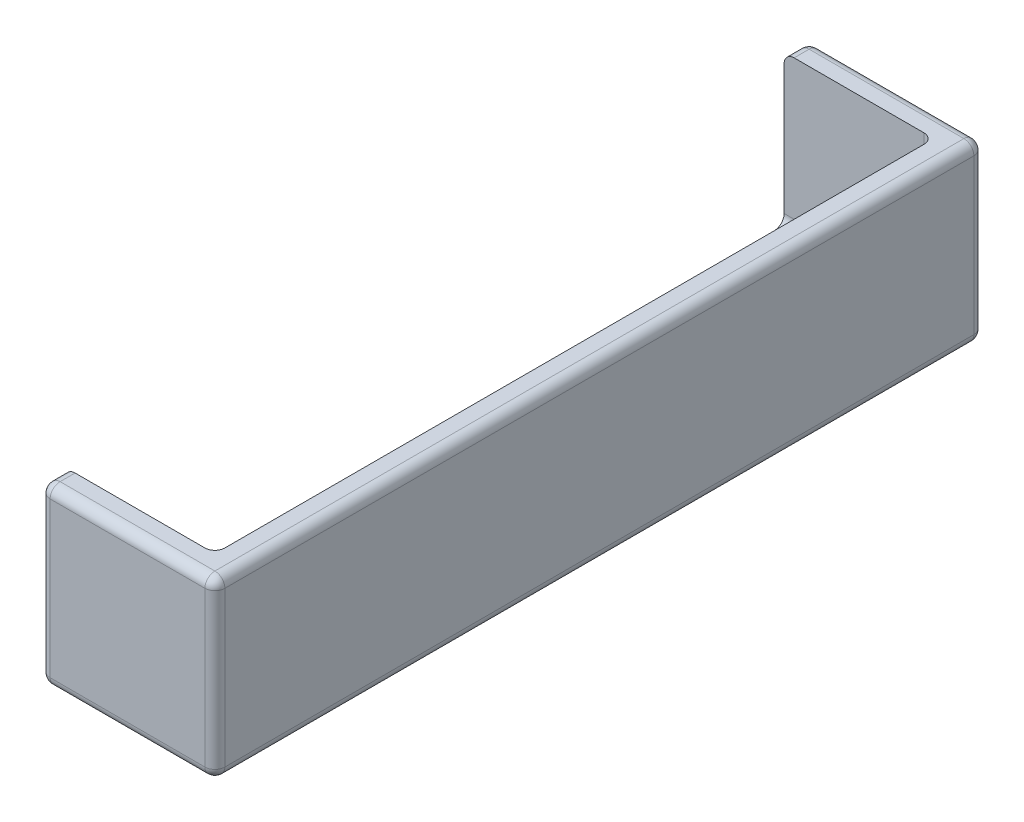
ISO-10303-21;
HEADER;
FILE_DESCRIPTION(('STEP AP214'),'2;1');
FILE_NAME('part.step','',(''),(''),'','','');
FILE_SCHEMA(('AUTOMOTIVE_DESIGN { 1 0 10303 214 1 1 1 1 }'));
ENDSEC;
DATA;
#1=APPLICATION_CONTEXT('core data for automotive mechanical design processes');
#2=APPLICATION_PROTOCOL_DEFINITION('international standard','automotive_design',2000,#1);
#3=PRODUCT_CONTEXT('',#1,'mechanical');
#4=PRODUCT('Part','Part','',(#3));
#5=PRODUCT_RELATED_PRODUCT_CATEGORY('part','',(#4));
#6=PRODUCT_DEFINITION_FORMATION('','',#4);
#7=PRODUCT_DEFINITION_CONTEXT('part definition',#1,'design');
#8=PRODUCT_DEFINITION('design','',#6,#7);
#9=PRODUCT_DEFINITION_SHAPE('','',#8);
#10=(LENGTH_UNIT() NAMED_UNIT(*) SI_UNIT(.MILLI.,.METRE.));
#11=(NAMED_UNIT(*) PLANE_ANGLE_UNIT() SI_UNIT($,.RADIAN.));
#12=(NAMED_UNIT(*) SI_UNIT($,.STERADIAN.) SOLID_ANGLE_UNIT());
#13=UNCERTAINTY_MEASURE_WITH_UNIT(LENGTH_MEASURE(1.E-05),#10,'distance_accuracy_value','');
#14=(GEOMETRIC_REPRESENTATION_CONTEXT(3) GLOBAL_UNCERTAINTY_ASSIGNED_CONTEXT((#13)) GLOBAL_UNIT_ASSIGNED_CONTEXT((#10,
#11,#12)) REPRESENTATION_CONTEXT('',''));
#15=CARTESIAN_POINT('',(0.,0.,0.));
#16=DIRECTION('',(0.,0.,1.));
#17=DIRECTION('',(1.,0.,0.));
#18=AXIS2_PLACEMENT_3D('',#15,#16,#17);
#19=CARTESIAN_POINT('',(17.5,0.,77.));
#20=DIRECTION('',(0.,-1.,0.));
#21=DIRECTION('',(0.,0.,-1.));
#22=AXIS2_PLACEMENT_3D('',#19,#20,#21);
#23=PLANE('',#22);
#24=DIRECTION('',(-1.,0.,0.));
#25=VECTOR('',#24,1.);
#26=CARTESIAN_POINT('',(0.,0.,76.));
#27=LINE('',#26,#25);
#28=CARTESIAN_POINT('',(16.5,0.,76.));
#29=VERTEX_POINT('',#28);
#30=CARTESIAN_POINT('',(1.,0.,76.));
#31=VERTEX_POINT('',#30);
#32=EDGE_CURVE('E383',#29,#31,#27,.T.);
#33=ORIENTED_EDGE('',*,*,#32,.T.);
#34=DIRECTION('',(0.,0.,-1.));
#35=VECTOR('',#34,1.);
#36=CARTESIAN_POINT('',(1.,0.,77.));
#37=LINE('',#36,#35);
#38=CARTESIAN_POINT('',(1.,0.,1.));
#39=VERTEX_POINT('',#38);
#40=EDGE_CURVE('E385',#31,#39,#37,.T.);
#41=ORIENTED_EDGE('',*,*,#40,.T.);
#42=DIRECTION('',(-1.,0.,0.));
#43=VECTOR('',#42,1.);
#44=CARTESIAN_POINT('',(17.5,0.,1.));
#45=LINE('',#44,#43);
#46=CARTESIAN_POINT('',(16.5,0.,1.));
#47=VERTEX_POINT('',#46);
#48=EDGE_CURVE('E379',#39,#47,#45,.F.);
#49=ORIENTED_EDGE('',*,*,#48,.T.);
#50=DIRECTION('',(0.,0.,-1.));
#51=VECTOR('',#50,1.);
#52=CARTESIAN_POINT('',(16.5,0.,77.));
#53=LINE('',#52,#51);
#54=EDGE_CURVE('E381',#47,#29,#53,.F.);
#55=ORIENTED_EDGE('',*,*,#54,.T.);
#56=EDGE_LOOP('',(#33,#41,#49,#55));
#57=FACE_BOUND('',#56,.T.);
#58=ADVANCED_FACE('F35',(#57),#23,.T.);
#59=CARTESIAN_POINT('',(17.5,17.5,77.));
#60=DIRECTION('',(1.,0.,0.));
#61=DIRECTION('',(0.,1.,0.));
#62=AXIS2_PLACEMENT_3D('',#59,#60,#61);
#63=PLANE('',#62);
#64=DIRECTION('',(0.,-1.,0.));
#65=VECTOR('',#64,1.);
#66=CARTESIAN_POINT('',(17.5,17.5,1.));
#67=LINE('',#66,#65);
#68=CARTESIAN_POINT('',(17.5,1.,1.));
#69=VERTEX_POINT('',#68);
#70=CARTESIAN_POINT('',(17.5,16.5,1.));
#71=VERTEX_POINT('',#70);
#72=EDGE_CURVE('E334',#69,#71,#67,.F.);
#73=ORIENTED_EDGE('',*,*,#72,.T.);
#74=DIRECTION('',(0.,0.,-1.));
#75=VECTOR('',#74,1.);
#76=CARTESIAN_POINT('',(17.5,16.5,77.));
#77=LINE('',#76,#75);
#78=CARTESIAN_POINT('',(17.5,16.5,76.));
#79=VERTEX_POINT('',#78);
#80=EDGE_CURVE('E340',#71,#79,#77,.F.);
#81=ORIENTED_EDGE('',*,*,#80,.T.);
#82=DIRECTION('',(0.,-1.,0.));
#83=VECTOR('',#82,1.);
#84=CARTESIAN_POINT('',(17.5,0.,76.));
#85=LINE('',#84,#83);
#86=CARTESIAN_POINT('',(17.5,1.,76.));
#87=VERTEX_POINT('',#86);
#88=EDGE_CURVE('E338',#79,#87,#85,.T.);
#89=ORIENTED_EDGE('',*,*,#88,.T.);
#90=DIRECTION('',(0.,0.,-1.));
#91=VECTOR('',#90,1.);
#92=CARTESIAN_POINT('',(17.5,1.,77.));
#93=LINE('',#92,#91);
#94=EDGE_CURVE('E336',#87,#69,#93,.T.);
#95=ORIENTED_EDGE('',*,*,#94,.T.);
#96=EDGE_LOOP('',(#73,#81,#89,#95));
#97=FACE_BOUND('',#96,.T.);
#98=ADVANCED_FACE('F455',(#97),#63,.T.);
#99=CARTESIAN_POINT('',(0.,17.5,77.));
#100=DIRECTION('',(0.,1.,0.));
#101=DIRECTION('',(0.,0.,1.));
#102=AXIS2_PLACEMENT_3D('',#99,#100,#101);
#103=PLANE('',#102);
#104=DIRECTION('',(1.,0.,0.));
#105=VECTOR('',#104,1.);
#106=CARTESIAN_POINT('',(0.,17.5,74.5));
#107=LINE('',#106,#105);
#108=CARTESIAN_POINT('',(1.,17.5,74.5));
#109=VERTEX_POINT('',#108);
#110=CARTESIAN_POINT('',(14.,17.5,74.5));
#111=VERTEX_POINT('',#110);
#112=EDGE_CURVE('E199',#109,#111,#107,.T.);
#113=ORIENTED_EDGE('',*,*,#112,.F.);
#114=DIRECTION('',(0.,0.,-1.));
#115=VECTOR('',#114,1.);
#116=CARTESIAN_POINT('',(1.,17.5,77.));
#117=LINE('',#116,#115);
#118=CARTESIAN_POINT('',(1.,17.5,76.));
#119=VERTEX_POINT('',#118);
#120=EDGE_CURVE('E332',#109,#119,#117,.F.);
#121=ORIENTED_EDGE('',*,*,#120,.T.);
#122=DIRECTION('',(1.,0.,0.));
#123=VECTOR('',#122,1.);
#124=CARTESIAN_POINT('',(17.5,17.5,76.));
#125=LINE('',#124,#123);
#126=CARTESIAN_POINT('',(16.5,17.5,76.));
#127=VERTEX_POINT('',#126);
#128=EDGE_CURVE('E330',#119,#127,#125,.T.);
#129=ORIENTED_EDGE('',*,*,#128,.T.);
#130=DIRECTION('',(0.,0.,-1.));
#131=VECTOR('',#130,1.);
#132=CARTESIAN_POINT('',(16.5,17.5,77.));
#133=LINE('',#132,#131);
#134=CARTESIAN_POINT('',(16.5,17.5,1.));
#135=VERTEX_POINT('',#134);
#136=EDGE_CURVE('E327',#127,#135,#133,.T.);
#137=ORIENTED_EDGE('',*,*,#136,.T.);
#138=DIRECTION('',(1.,0.,0.));
#139=VECTOR('',#138,1.);
#140=CARTESIAN_POINT('',(0.,17.5,1.));
#141=LINE('',#140,#139);
#142=CARTESIAN_POINT('',(1.,17.5,1.));
#143=VERTEX_POINT('',#142);
#144=EDGE_CURVE('E321',#135,#143,#141,.F.);
#145=ORIENTED_EDGE('',*,*,#144,.T.);
#146=DIRECTION('',(0.,0.,-1.));
#147=VECTOR('',#146,1.);
#148=CARTESIAN_POINT('',(1.,17.5,77.));
#149=LINE('',#148,#147);
#150=CARTESIAN_POINT('',(1.,17.5,2.5));
#151=VERTEX_POINT('',#150);
#152=EDGE_CURVE('E197',#143,#151,#149,.F.);
#153=ORIENTED_EDGE('',*,*,#152,.T.);
#154=DIRECTION('',(-1.,0.,0.));
#155=VECTOR('',#154,1.);
#156=CARTESIAN_POINT('',(0.,17.5,2.5));
#157=LINE('',#156,#155);
#158=CARTESIAN_POINT('',(14.,17.5,2.5));
#159=VERTEX_POINT('',#158);
#160=EDGE_CURVE('E182',#159,#151,#157,.T.);
#161=ORIENTED_EDGE('',*,*,#160,.F.);
#162=CARTESIAN_POINT('',(14.,17.5,3.5));
#163=DIRECTION('',(0.,1.,0.));
#164=DIRECTION('',(0.,0.,1.));
#165=AXIS2_PLACEMENT_3D('',#162,#163,#164);
#166=CIRCLE('',#165,1.);
#167=CARTESIAN_POINT('',(15.,17.5,3.5));
#168=VERTEX_POINT('',#167);
#169=EDGE_CURVE('E11',#159,#168,#166,.F.);
#170=ORIENTED_EDGE('',*,*,#169,.T.);
#171=DIRECTION('',(0.,0.,1.));
#172=VECTOR('',#171,1.);
#173=CARTESIAN_POINT('',(15.,17.5,77.));
#174=LINE('',#173,#172);
#175=CARTESIAN_POINT('',(15.,17.5,73.5));
#176=VERTEX_POINT('',#175);
#177=EDGE_CURVE('E319',#168,#176,#174,.T.);
#178=ORIENTED_EDGE('',*,*,#177,.T.);
#179=CARTESIAN_POINT('',(14.,17.5,73.5));
#180=DIRECTION('',(0.,1.,0.));
#181=DIRECTION('',(0.,0.,1.));
#182=AXIS2_PLACEMENT_3D('',#179,#180,#181);
#183=CIRCLE('',#182,1.);
#184=EDGE_CURVE('E214',#176,#111,#183,.F.);
#185=ORIENTED_EDGE('',*,*,#184,.T.);
#186=EDGE_LOOP('',(#113,#121,#129,#137,#145,#153,#161,#170,#178,#185));
#187=FACE_BOUND('',#186,.T.);
#188=ADVANCED_FACE('F194',(#187),#103,.T.);
#189=CARTESIAN_POINT('',(0.,0.,77.));
#190=DIRECTION('',(-1.,0.,0.));
#191=DIRECTION('',(0.,0.,1.));
#192=AXIS2_PLACEMENT_3D('',#189,#190,#191);
#193=PLANE('',#192);
#194=DIRECTION('',(0.,-1.,0.));
#195=VECTOR('',#194,1.);
#196=CARTESIAN_POINT('',(0.,0.,2.5));
#197=LINE('',#196,#195);
#198=CARTESIAN_POINT('',(0.,16.5,2.5));
#199=VERTEX_POINT('',#198);
#200=CARTESIAN_POINT('',(0.,3.5,2.5));
#201=VERTEX_POINT('',#200);
#202=EDGE_CURVE('E198',#199,#201,#197,.T.);
#203=ORIENTED_EDGE('',*,*,#202,.F.);
#204=DIRECTION('',(0.,0.,-1.));
#205=VECTOR('',#204,1.);
#206=CARTESIAN_POINT('',(0.,16.5,77.));
#207=LINE('',#206,#205);
#208=CARTESIAN_POINT('',(0.,16.5,1.));
#209=VERTEX_POINT('',#208);
#210=EDGE_CURVE('E190',#199,#209,#207,.T.);
#211=ORIENTED_EDGE('',*,*,#210,.T.);
#212=DIRECTION('',(0.,1.,0.));
#213=VECTOR('',#212,1.);
#214=CARTESIAN_POINT('',(0.,0.,1.));
#215=LINE('',#214,#213);
#216=CARTESIAN_POINT('',(0.,1.,1.));
#217=VERTEX_POINT('',#216);
#218=EDGE_CURVE('E345',#209,#217,#215,.F.);
#219=ORIENTED_EDGE('',*,*,#218,.T.);
#220=DIRECTION('',(0.,0.,-1.));
#221=VECTOR('',#220,1.);
#222=CARTESIAN_POINT('',(0.,1.,77.));
#223=LINE('',#222,#221);
#224=CARTESIAN_POINT('',(0.,1.,76.));
#225=VERTEX_POINT('',#224);
#226=EDGE_CURVE('E343',#217,#225,#223,.F.);
#227=ORIENTED_EDGE('',*,*,#226,.T.);
#228=DIRECTION('',(0.,1.,0.));
#229=VECTOR('',#228,1.);
#230=CARTESIAN_POINT('',(0.,17.5,76.));
#231=LINE('',#230,#229);
#232=CARTESIAN_POINT('',(0.,16.5,76.));
#233=VERTEX_POINT('',#232);
#234=EDGE_CURVE('E347',#225,#233,#231,.T.);
#235=ORIENTED_EDGE('',*,*,#234,.T.);
#236=DIRECTION('',(0.,0.,-1.));
#237=VECTOR('',#236,1.);
#238=CARTESIAN_POINT('',(0.,16.5,77.));
#239=LINE('',#238,#237);
#240=CARTESIAN_POINT('',(0.,16.5,74.5));
#241=VERTEX_POINT('',#240);
#242=EDGE_CURVE('E349',#233,#241,#239,.T.);
#243=ORIENTED_EDGE('',*,*,#242,.T.);
#244=DIRECTION('',(0.,1.,0.));
#245=VECTOR('',#244,1.);
#246=CARTESIAN_POINT('',(0.,22.5,74.5));
#247=LINE('',#246,#245);
#248=CARTESIAN_POINT('',(0.,3.5,74.5));
#249=VERTEX_POINT('',#248);
#250=EDGE_CURVE('E401',#249,#241,#247,.T.);
#251=ORIENTED_EDGE('',*,*,#250,.F.);
#252=CARTESIAN_POINT('',(0.,3.5,73.5));
#253=DIRECTION('',(-1.,0.,0.));
#254=DIRECTION('',(0.,0.,1.));
#255=AXIS2_PLACEMENT_3D('',#252,#253,#254);
#256=CIRCLE('',#255,1.);
#257=CARTESIAN_POINT('',(0.,2.5,73.5));
#258=VERTEX_POINT('',#257);
#259=EDGE_CURVE('E207',#249,#258,#256,.F.);
#260=ORIENTED_EDGE('',*,*,#259,.T.);
#261=DIRECTION('',(0.,0.,1.));
#262=VECTOR('',#261,1.);
#263=CARTESIAN_POINT('',(0.,2.5,2.5));
#264=LINE('',#263,#262);
#265=CARTESIAN_POINT('',(0.,2.5,3.5));
#266=VERTEX_POINT('',#265);
#267=EDGE_CURVE('E286',#266,#258,#264,.T.);
#268=ORIENTED_EDGE('',*,*,#267,.F.);
#269=CARTESIAN_POINT('',(0.,3.5,3.5));
#270=DIRECTION('',(-1.,0.,0.));
#271=DIRECTION('',(0.,0.,1.));
#272=AXIS2_PLACEMENT_3D('',#269,#270,#271);
#273=CIRCLE('',#272,1.);
#274=EDGE_CURVE('E44',#266,#201,#273,.F.);
#275=ORIENTED_EDGE('',*,*,#274,.T.);
#276=EDGE_LOOP('',(#203,#211,#219,#227,#235,#243,#251,#260,#268,#275));
#277=FACE_BOUND('',#276,.T.);
#278=ADVANCED_FACE('F405',(#277),#193,.T.);
#279=CARTESIAN_POINT('',(0.,0.,77.));
#280=DIRECTION('',(0.,0.,-1.));
#281=DIRECTION('',(-1.,0.,0.));
#282=AXIS2_PLACEMENT_3D('',#279,#280,#281);
#283=PLANE('',#282);
#284=DIRECTION('',(1.,0.,0.));
#285=VECTOR('',#284,1.);
#286=CARTESIAN_POINT('',(0.,16.5,77.));
#287=LINE('',#286,#285);
#288=CARTESIAN_POINT('',(16.5,16.5,77.));
#289=VERTEX_POINT('',#288);
#290=CARTESIAN_POINT('',(1.,16.5,77.));
#291=VERTEX_POINT('',#290);
#292=EDGE_CURVE('E365',#289,#291,#287,.F.);
#293=ORIENTED_EDGE('',*,*,#292,.T.);
#294=DIRECTION('',(0.,1.,0.));
#295=VECTOR('',#294,1.);
#296=CARTESIAN_POINT('',(1.,0.,77.));
#297=LINE('',#296,#295);
#298=CARTESIAN_POINT('',(1.,1.,77.));
#299=VERTEX_POINT('',#298);
#300=EDGE_CURVE('E367',#291,#299,#297,.F.);
#301=ORIENTED_EDGE('',*,*,#300,.T.);
#302=DIRECTION('',(-1.,0.,0.));
#303=VECTOR('',#302,1.);
#304=CARTESIAN_POINT('',(17.5,1.,77.));
#305=LINE('',#304,#303);
#306=CARTESIAN_POINT('',(16.5,1.,77.));
#307=VERTEX_POINT('',#306);
#308=EDGE_CURVE('E361',#299,#307,#305,.F.);
#309=ORIENTED_EDGE('',*,*,#308,.T.);
#310=DIRECTION('',(0.,-1.,0.));
#311=VECTOR('',#310,1.);
#312=CARTESIAN_POINT('',(16.5,17.5,77.));
#313=LINE('',#312,#311);
#314=EDGE_CURVE('E363',#307,#289,#313,.F.);
#315=ORIENTED_EDGE('',*,*,#314,.T.);
#316=EDGE_LOOP('',(#293,#301,#309,#315));
#317=FACE_BOUND('',#316,.T.);
#318=ADVANCED_FACE('F721',(#317),#283,.F.);
#319=CARTESIAN_POINT('',(0.,0.,0.));
#320=DIRECTION('',(0.,0.,-1.));
#321=DIRECTION('',(-1.,0.,0.));
#322=AXIS2_PLACEMENT_3D('',#319,#320,#321);
#323=PLANE('',#322);
#324=DIRECTION('',(0.,1.,0.));
#325=VECTOR('',#324,1.);
#326=CARTESIAN_POINT('',(1.,0.,0.));
#327=LINE('',#326,#325);
#328=CARTESIAN_POINT('',(1.,1.,0.));
#329=VERTEX_POINT('',#328);
#330=CARTESIAN_POINT('',(1.,16.5,0.));
#331=VERTEX_POINT('',#330);
#332=EDGE_CURVE('E374',#329,#331,#327,.T.);
#333=ORIENTED_EDGE('',*,*,#332,.T.);
#334=DIRECTION('',(1.,0.,0.));
#335=VECTOR('',#334,1.);
#336=CARTESIAN_POINT('',(0.,16.5,0.));
#337=LINE('',#336,#335);
#338=CARTESIAN_POINT('',(16.5,16.5,0.));
#339=VERTEX_POINT('',#338);
#340=EDGE_CURVE('E376',#331,#339,#337,.T.);
#341=ORIENTED_EDGE('',*,*,#340,.T.);
#342=DIRECTION('',(0.,-1.,0.));
#343=VECTOR('',#342,1.);
#344=CARTESIAN_POINT('',(16.5,0.,0.));
#345=LINE('',#344,#343);
#346=CARTESIAN_POINT('',(16.5,1.,0.));
#347=VERTEX_POINT('',#346);
#348=EDGE_CURVE('E372',#339,#347,#345,.T.);
#349=ORIENTED_EDGE('',*,*,#348,.T.);
#350=DIRECTION('',(-1.,0.,0.));
#351=VECTOR('',#350,1.);
#352=CARTESIAN_POINT('',(0.,1.,0.));
#353=LINE('',#352,#351);
#354=EDGE_CURVE('E370',#347,#329,#353,.T.);
#355=ORIENTED_EDGE('',*,*,#354,.T.);
#356=EDGE_LOOP('',(#333,#341,#349,#355));
#357=FACE_BOUND('',#356,.T.);
#358=ADVANCED_FACE('F713',(#357),#323,.T.);
#359=CARTESIAN_POINT('',(15.,22.5,2.5));
#360=DIRECTION('',(0.,0.,-1.));
#361=DIRECTION('',(-1.,0.,0.));
#362=AXIS2_PLACEMENT_3D('',#359,#360,#361);
#363=PLANE('',#362);
#364=ORIENTED_EDGE('',*,*,#160,.T.);
#365=CARTESIAN_POINT('',(1.,16.5,2.5));
#366=DIRECTION('',(0.,0.,-1.));
#367=DIRECTION('',(-1.,0.,0.));
#368=AXIS2_PLACEMENT_3D('',#365,#366,#367);
#369=CIRCLE('',#368,1.);
#370=EDGE_CURVE('E353',#151,#199,#369,.F.);
#371=ORIENTED_EDGE('',*,*,#370,.T.);
#372=ORIENTED_EDGE('',*,*,#202,.T.);
#373=DIRECTION('',(-1.,0.,0.));
#374=VECTOR('',#373,1.);
#375=CARTESIAN_POINT('',(15.,3.5,2.5));
#376=LINE('',#375,#374);
#377=CARTESIAN_POINT('',(14.,3.5,2.5));
#378=VERTEX_POINT('',#377);
#379=EDGE_CURVE('E186',#201,#378,#376,.F.);
#380=ORIENTED_EDGE('',*,*,#379,.T.);
#381=DIRECTION('',(0.,-1.,0.));
#382=VECTOR('',#381,1.);
#383=CARTESIAN_POINT('',(14.,22.5,2.5));
#384=LINE('',#383,#382);
#385=EDGE_CURVE('E179',#378,#159,#384,.F.);
#386=ORIENTED_EDGE('',*,*,#385,.T.);
#387=EDGE_LOOP('',(#364,#371,#372,#380,#386));
#388=FACE_BOUND('',#387,.T.);
#389=ADVANCED_FACE('F181',(#388),#363,.F.);
#390=CARTESIAN_POINT('',(15.,22.5,74.5));
#391=DIRECTION('',(0.,0.,1.));
#392=DIRECTION('',(1.,0.,0.));
#393=AXIS2_PLACEMENT_3D('',#390,#391,#392);
#394=PLANE('',#393);
#395=ORIENTED_EDGE('',*,*,#250,.T.);
#396=CARTESIAN_POINT('',(1.,16.5,74.5));
#397=DIRECTION('',(0.,0.,1.));
#398=DIRECTION('',(1.,0.,0.));
#399=AXIS2_PLACEMENT_3D('',#396,#397,#398);
#400=CIRCLE('',#399,1.);
#401=EDGE_CURVE('E359',#241,#109,#400,.F.);
#402=ORIENTED_EDGE('',*,*,#401,.T.);
#403=ORIENTED_EDGE('',*,*,#112,.T.);
#404=DIRECTION('',(0.,1.,0.));
#405=VECTOR('',#404,1.);
#406=CARTESIAN_POINT('',(14.,22.5,74.5));
#407=LINE('',#406,#405);
#408=CARTESIAN_POINT('',(14.,3.5,74.5));
#409=VERTEX_POINT('',#408);
#410=EDGE_CURVE('E317',#111,#409,#407,.F.);
#411=ORIENTED_EDGE('',*,*,#410,.T.);
#412=DIRECTION('',(-1.,0.,0.));
#413=VECTOR('',#412,1.);
#414=CARTESIAN_POINT('',(0.,3.5,74.5));
#415=LINE('',#414,#413);
#416=EDGE_CURVE('E356',#409,#249,#415,.T.);
#417=ORIENTED_EDGE('',*,*,#416,.T.);
#418=EDGE_LOOP('',(#395,#402,#403,#411,#417));
#419=FACE_BOUND('',#418,.T.);
#420=ADVANCED_FACE('F400',(#419),#394,.F.);
#421=CARTESIAN_POINT('',(15.,2.5,2.5));
#422=DIRECTION('',(0.,-1.,0.));
#423=DIRECTION('',(0.,0.,-1.));
#424=AXIS2_PLACEMENT_3D('',#421,#422,#423);
#425=PLANE('',#424);
#426=ORIENTED_EDGE('',*,*,#267,.T.);
#427=DIRECTION('',(-1.,0.,0.));
#428=VECTOR('',#427,1.);
#429=CARTESIAN_POINT('',(15.,2.5,73.5));
#430=LINE('',#429,#428);
#431=CARTESIAN_POINT('',(14.,2.5,73.5));
#432=VERTEX_POINT('',#431);
#433=EDGE_CURVE('E209',#258,#432,#430,.F.);
#434=ORIENTED_EDGE('',*,*,#433,.T.);
#435=DIRECTION('',(0.,0.,1.));
#436=VECTOR('',#435,1.);
#437=CARTESIAN_POINT('',(14.,2.5,2.5));
#438=LINE('',#437,#436);
#439=CARTESIAN_POINT('',(14.,2.5,3.5));
#440=VERTEX_POINT('',#439);
#441=EDGE_CURVE('E307',#432,#440,#438,.F.);
#442=ORIENTED_EDGE('',*,*,#441,.T.);
#443=DIRECTION('',(-1.,0.,0.));
#444=VECTOR('',#443,1.);
#445=CARTESIAN_POINT('',(0.,2.5,3.5));
#446=LINE('',#445,#444);
#447=EDGE_CURVE('E389',#440,#266,#446,.T.);
#448=ORIENTED_EDGE('',*,*,#447,.T.);
#449=EDGE_LOOP('',(#426,#434,#442,#448));
#450=FACE_BOUND('',#449,.T.);
#451=ADVANCED_FACE('F393',(#450),#425,.F.);
#452=CARTESIAN_POINT('',(15.,0.,0.));
#453=DIRECTION('',(-1.,0.,0.));
#454=DIRECTION('',(0.,0.,1.));
#455=AXIS2_PLACEMENT_3D('',#452,#453,#454);
#456=PLANE('',#455);
#457=DIRECTION('',(0.,0.,1.));
#458=VECTOR('',#457,1.);
#459=CARTESIAN_POINT('',(15.,3.5,0.));
#460=LINE('',#459,#458);
#461=CARTESIAN_POINT('',(15.,3.5,3.5));
#462=VERTEX_POINT('',#461);
#463=CARTESIAN_POINT('',(15.,3.5,73.5));
#464=VERTEX_POINT('',#463);
#465=EDGE_CURVE('E52',#462,#464,#460,.T.);
#466=ORIENTED_EDGE('',*,*,#465,.T.);
#467=DIRECTION('',(0.,1.,0.));
#468=VECTOR('',#467,1.);
#469=CARTESIAN_POINT('',(15.,0.,73.5));
#470=LINE('',#469,#468);
#471=EDGE_CURVE('E205',#464,#176,#470,.T.);
#472=ORIENTED_EDGE('',*,*,#471,.T.);
#473=ORIENTED_EDGE('',*,*,#177,.F.);
#474=DIRECTION('',(0.,-1.,0.));
#475=VECTOR('',#474,1.);
#476=CARTESIAN_POINT('',(15.,0.,3.5));
#477=LINE('',#476,#475);
#478=EDGE_CURVE('E57',#168,#462,#477,.T.);
#479=ORIENTED_EDGE('',*,*,#478,.T.);
#480=EDGE_LOOP('',(#466,#472,#473,#479));
#481=FACE_BOUND('',#480,.T.);
#482=ADVANCED_FACE('F318',(#481),#456,.T.);
#483=CARTESIAN_POINT('',(1.,1.,77.));
#484=DIRECTION('',(0.,0.,-1.));
#485=DIRECTION('',(-1.,0.,0.));
#486=AXIS2_PLACEMENT_3D('',#483,#484,#485);
#487=CYLINDRICAL_SURFACE('',#486,1.);
#488=CARTESIAN_POINT('',(1.,1.,76.));
#489=DIRECTION('',(0.,0.,1.));
#490=DIRECTION('',(1.,0.,0.));
#491=AXIS2_PLACEMENT_3D('',#488,#489,#490);
#492=CIRCLE('',#491,1.);
#493=EDGE_CURVE('E283',#225,#31,#492,.T.);
#494=ORIENTED_EDGE('',*,*,#493,.F.);
#495=ORIENTED_EDGE('',*,*,#226,.F.);
#496=CARTESIAN_POINT('',(1.,1.,1.));
#497=DIRECTION('',(0.,0.,-1.));
#498=DIRECTION('',(-1.,0.,0.));
#499=AXIS2_PLACEMENT_3D('',#496,#497,#498);
#500=CIRCLE('',#499,1.);
#501=EDGE_CURVE('E280',#39,#217,#500,.T.);
#502=ORIENTED_EDGE('',*,*,#501,.F.);
#503=ORIENTED_EDGE('',*,*,#40,.F.);
#504=EDGE_LOOP('',(#494,#495,#502,#503));
#505=FACE_BOUND('',#504,.T.);
#506=ADVANCED_FACE('F527',(#505),#487,.T.);
#507=CARTESIAN_POINT('',(1.,1.,76.));
#508=DIRECTION('',(0.,0.,1.));
#509=DIRECTION('',(1.,0.,0.));
#510=AXIS2_PLACEMENT_3D('',#507,#508,#509);
#511=SPHERICAL_SURFACE('',#510,1.);
#512=CARTESIAN_POINT('',(1.,1.,76.));
#513=DIRECTION('',(0.,-1.,0.));
#514=DIRECTION('',(0.,0.,-1.));
#515=AXIS2_PLACEMENT_3D('',#512,#513,#514);
#516=CIRCLE('',#515,1.);
#517=EDGE_CURVE('E274',#225,#299,#516,.F.);
#518=ORIENTED_EDGE('',*,*,#517,.F.);
#519=ORIENTED_EDGE('',*,*,#493,.T.);
#520=CARTESIAN_POINT('',(1.,1.,76.));
#521=DIRECTION('',(-1.,0.,0.));
#522=DIRECTION('',(0.,0.,1.));
#523=AXIS2_PLACEMENT_3D('',#520,#521,#522);
#524=CIRCLE('',#523,1.);
#525=EDGE_CURVE('E277',#299,#31,#524,.F.);
#526=ORIENTED_EDGE('',*,*,#525,.F.);
#527=EDGE_LOOP('',(#518,#519,#526));
#528=FACE_BOUND('',#527,.T.);
#529=ADVANCED_FACE('F523',(#528),#511,.T.);
#530=CARTESIAN_POINT('',(1.,1.,1.));
#531=DIRECTION('',(0.,0.,1.));
#532=DIRECTION('',(1.,0.,0.));
#533=AXIS2_PLACEMENT_3D('',#530,#531,#532);
#534=SPHERICAL_SURFACE('',#533,1.);
#535=CARTESIAN_POINT('',(1.,1.,1.));
#536=DIRECTION('',(-1.,0.,0.));
#537=DIRECTION('',(0.,-1.,0.));
#538=AXIS2_PLACEMENT_3D('',#535,#536,#537);
#539=CIRCLE('',#538,1.);
#540=EDGE_CURVE('E268',#39,#329,#539,.F.);
#541=ORIENTED_EDGE('',*,*,#540,.F.);
#542=ORIENTED_EDGE('',*,*,#501,.T.);
#543=CARTESIAN_POINT('',(1.,1.,1.));
#544=DIRECTION('',(0.,-1.,0.));
#545=DIRECTION('',(0.,0.,-1.));
#546=AXIS2_PLACEMENT_3D('',#543,#544,#545);
#547=CIRCLE('',#546,1.);
#548=EDGE_CURVE('E271',#329,#217,#547,.F.);
#549=ORIENTED_EDGE('',*,*,#548,.F.);
#550=EDGE_LOOP('',(#541,#542,#549));
#551=FACE_BOUND('',#550,.T.);
#552=ADVANCED_FACE('F519',(#551),#534,.T.);
#553=CARTESIAN_POINT('',(17.5,1.,76.));
#554=DIRECTION('',(1.,0.,0.));
#555=DIRECTION('',(0.,0.,-1.));
#556=AXIS2_PLACEMENT_3D('',#553,#554,#555);
#557=CYLINDRICAL_SURFACE('',#556,1.);
#558=ORIENTED_EDGE('',*,*,#525,.T.);
#559=ORIENTED_EDGE('',*,*,#32,.F.);
#560=CARTESIAN_POINT('',(16.5,1.,76.));
#561=DIRECTION('',(1.,0.,0.));
#562=DIRECTION('',(0.,0.,-1.));
#563=AXIS2_PLACEMENT_3D('',#560,#561,#562);
#564=CIRCLE('',#563,1.);
#565=EDGE_CURVE('E262',#307,#29,#564,.T.);
#566=ORIENTED_EDGE('',*,*,#565,.F.);
#567=ORIENTED_EDGE('',*,*,#308,.F.);
#568=EDGE_LOOP('',(#558,#559,#566,#567));
#569=FACE_BOUND('',#568,.T.);
#570=ADVANCED_FACE('F515',(#569),#557,.T.);
#571=CARTESIAN_POINT('',(1.,0.,76.));
#572=DIRECTION('',(0.,-1.,0.));
#573=DIRECTION('',(0.,0.,-1.));
#574=AXIS2_PLACEMENT_3D('',#571,#572,#573);
#575=CYLINDRICAL_SURFACE('',#574,1.);
#576=ORIENTED_EDGE('',*,*,#517,.T.);
#577=ORIENTED_EDGE('',*,*,#300,.F.);
#578=CARTESIAN_POINT('',(1.,16.5,76.));
#579=DIRECTION('',(0.,1.,0.));
#580=DIRECTION('',(0.,0.,1.));
#581=AXIS2_PLACEMENT_3D('',#578,#579,#580);
#582=CIRCLE('',#581,1.);
#583=EDGE_CURVE('E259',#233,#291,#582,.T.);
#584=ORIENTED_EDGE('',*,*,#583,.F.);
#585=ORIENTED_EDGE('',*,*,#234,.F.);
#586=EDGE_LOOP('',(#576,#577,#584,#585));
#587=FACE_BOUND('',#586,.T.);
#588=ADVANCED_FACE('F512',(#587),#575,.T.);
#589=CARTESIAN_POINT('',(1.,16.5,77.));
#590=DIRECTION('',(0.,0.,-1.));
#591=DIRECTION('',(-1.,0.,0.));
#592=AXIS2_PLACEMENT_3D('',#589,#590,#591);
#593=CYLINDRICAL_SURFACE('',#592,1.);
#594=ORIENTED_EDGE('',*,*,#401,.F.);
#595=ORIENTED_EDGE('',*,*,#242,.F.);
#596=CARTESIAN_POINT('',(1.,16.5,76.));
#597=DIRECTION('',(0.,0.,1.));
#598=DIRECTION('',(1.,0.,0.));
#599=AXIS2_PLACEMENT_3D('',#596,#597,#598);
#600=CIRCLE('',#599,1.);
#601=EDGE_CURVE('E256',#119,#233,#600,.T.);
#602=ORIENTED_EDGE('',*,*,#601,.F.);
#603=ORIENTED_EDGE('',*,*,#120,.F.);
#604=EDGE_LOOP('',(#594,#595,#602,#603));
#605=FACE_BOUND('',#604,.T.);
#606=ADVANCED_FACE('F413',(#605),#593,.T.);
#607=CARTESIAN_POINT('',(1.,16.5,77.));
#608=DIRECTION('',(0.,0.,-1.));
#609=DIRECTION('',(-1.,0.,0.));
#610=AXIS2_PLACEMENT_3D('',#607,#608,#609);
#611=CYLINDRICAL_SURFACE('',#610,1.);
#612=ORIENTED_EDGE('',*,*,#370,.F.);
#613=ORIENTED_EDGE('',*,*,#152,.F.);
#614=CARTESIAN_POINT('',(1.,16.5,1.));
#615=DIRECTION('',(0.,0.,-1.));
#616=DIRECTION('',(-1.,0.,0.));
#617=AXIS2_PLACEMENT_3D('',#614,#615,#616);
#618=CIRCLE('',#617,1.);
#619=EDGE_CURVE('E253',#209,#143,#618,.T.);
#620=ORIENTED_EDGE('',*,*,#619,.F.);
#621=ORIENTED_EDGE('',*,*,#210,.F.);
#622=EDGE_LOOP('',(#612,#613,#620,#621));
#623=FACE_BOUND('',#622,.T.);
#624=ADVANCED_FACE('F445',(#623),#611,.T.);
#625=CARTESIAN_POINT('',(1.,0.,1.));
#626=DIRECTION('',(0.,1.,0.));
#627=DIRECTION('',(0.,0.,1.));
#628=AXIS2_PLACEMENT_3D('',#625,#626,#627);
#629=CYLINDRICAL_SURFACE('',#628,1.);
#630=ORIENTED_EDGE('',*,*,#548,.T.);
#631=ORIENTED_EDGE('',*,*,#218,.F.);
#632=CARTESIAN_POINT('',(1.,16.5,1.));
#633=DIRECTION('',(0.,1.,0.));
#634=DIRECTION('',(0.,0.,1.));
#635=AXIS2_PLACEMENT_3D('',#632,#633,#634);
#636=CIRCLE('',#635,1.);
#637=EDGE_CURVE('E250',#331,#209,#636,.T.);
#638=ORIENTED_EDGE('',*,*,#637,.F.);
#639=ORIENTED_EDGE('',*,*,#332,.F.);
#640=EDGE_LOOP('',(#630,#631,#638,#639));
#641=FACE_BOUND('',#640,.T.);
#642=ADVANCED_FACE('F503',(#641),#629,.T.);
#643=CARTESIAN_POINT('',(0.,1.,1.));
#644=DIRECTION('',(-1.,0.,0.));
#645=DIRECTION('',(0.,0.,1.));
#646=AXIS2_PLACEMENT_3D('',#643,#644,#645);
#647=CYLINDRICAL_SURFACE('',#646,1.);
#648=ORIENTED_EDGE('',*,*,#540,.T.);
#649=ORIENTED_EDGE('',*,*,#354,.F.);
#650=CARTESIAN_POINT('',(16.5,1.,1.));
#651=DIRECTION('',(1.,0.,0.));
#652=DIRECTION('',(0.,0.,-1.));
#653=AXIS2_PLACEMENT_3D('',#650,#651,#652);
#654=CIRCLE('',#653,1.);
#655=EDGE_CURVE('E247',#47,#347,#654,.T.);
#656=ORIENTED_EDGE('',*,*,#655,.F.);
#657=ORIENTED_EDGE('',*,*,#48,.F.);
#658=EDGE_LOOP('',(#648,#649,#656,#657));
#659=FACE_BOUND('',#658,.T.);
#660=ADVANCED_FACE('F499',(#659),#647,.T.);
#661=CARTESIAN_POINT('',(16.5,1.,77.));
#662=DIRECTION('',(0.,0.,-1.));
#663=DIRECTION('',(-1.,0.,0.));
#664=AXIS2_PLACEMENT_3D('',#661,#662,#663);
#665=CYLINDRICAL_SURFACE('',#664,1.);
#666=CARTESIAN_POINT('',(16.5,1.,76.));
#667=DIRECTION('',(0.,0.,1.));
#668=DIRECTION('',(1.,0.,0.));
#669=AXIS2_PLACEMENT_3D('',#666,#667,#668);
#670=CIRCLE('',#669,1.);
#671=EDGE_CURVE('E265',#29,#87,#670,.T.);
#672=ORIENTED_EDGE('',*,*,#671,.F.);
#673=ORIENTED_EDGE('',*,*,#54,.F.);
#674=CARTESIAN_POINT('',(16.5,1.,1.));
#675=DIRECTION('',(0.,0.,-1.));
#676=DIRECTION('',(-1.,0.,0.));
#677=AXIS2_PLACEMENT_3D('',#674,#675,#676);
#678=CIRCLE('',#677,1.);
#679=EDGE_CURVE('E244',#69,#47,#678,.T.);
#680=ORIENTED_EDGE('',*,*,#679,.F.);
#681=ORIENTED_EDGE('',*,*,#94,.F.);
#682=EDGE_LOOP('',(#672,#673,#680,#681));
#683=FACE_BOUND('',#682,.T.);
#684=ADVANCED_FACE('F495',(#683),#665,.T.);
#685=CARTESIAN_POINT('',(16.5,1.,76.));
#686=DIRECTION('',(0.,0.,1.));
#687=DIRECTION('',(1.,0.,0.));
#688=AXIS2_PLACEMENT_3D('',#685,#686,#687);
#689=SPHERICAL_SURFACE('',#688,1.);
#690=ORIENTED_EDGE('',*,*,#565,.T.);
#691=ORIENTED_EDGE('',*,*,#671,.T.);
#692=CARTESIAN_POINT('',(16.5,1.,76.));
#693=DIRECTION('',(0.,-1.,0.));
#694=DIRECTION('',(0.,0.,-1.));
#695=AXIS2_PLACEMENT_3D('',#692,#693,#694);
#696=CIRCLE('',#695,1.);
#697=EDGE_CURVE('E241',#307,#87,#696,.F.);
#698=ORIENTED_EDGE('',*,*,#697,.F.);
#699=EDGE_LOOP('',(#690,#691,#698));
#700=FACE_BOUND('',#699,.T.);
#701=ADVANCED_FACE('F492',(#700),#689,.T.);
#702=CARTESIAN_POINT('',(1.,16.5,76.));
#703=DIRECTION('',(0.,0.,1.));
#704=DIRECTION('',(1.,0.,0.));
#705=AXIS2_PLACEMENT_3D('',#702,#703,#704);
#706=SPHERICAL_SURFACE('',#705,1.);
#707=ORIENTED_EDGE('',*,*,#601,.T.);
#708=ORIENTED_EDGE('',*,*,#583,.T.);
#709=CARTESIAN_POINT('',(1.,16.5,76.));
#710=DIRECTION('',(-1.,0.,0.));
#711=DIRECTION('',(0.,0.,1.));
#712=AXIS2_PLACEMENT_3D('',#709,#710,#711);
#713=CIRCLE('',#712,1.);
#714=EDGE_CURVE('E238',#119,#291,#713,.F.);
#715=ORIENTED_EDGE('',*,*,#714,.F.);
#716=EDGE_LOOP('',(#707,#708,#715));
#717=FACE_BOUND('',#716,.T.);
#718=ADVANCED_FACE('F418',(#717),#706,.T.);
#719=CARTESIAN_POINT('',(1.,16.5,1.));
#720=DIRECTION('',(0.,0.,1.));
#721=DIRECTION('',(1.,0.,0.));
#722=AXIS2_PLACEMENT_3D('',#719,#720,#721);
#723=SPHERICAL_SURFACE('',#722,1.);
#724=ORIENTED_EDGE('',*,*,#637,.T.);
#725=ORIENTED_EDGE('',*,*,#619,.T.);
#726=CARTESIAN_POINT('',(1.,16.5,1.));
#727=DIRECTION('',(-1.,0.,0.));
#728=DIRECTION('',(0.,0.,1.));
#729=AXIS2_PLACEMENT_3D('',#726,#727,#728);
#730=CIRCLE('',#729,1.);
#731=EDGE_CURVE('E235',#331,#143,#730,.F.);
#732=ORIENTED_EDGE('',*,*,#731,.F.);
#733=EDGE_LOOP('',(#724,#725,#732));
#734=FACE_BOUND('',#733,.T.);
#735=ADVANCED_FACE('F440',(#734),#723,.T.);
#736=CARTESIAN_POINT('',(16.5,1.,1.));
#737=DIRECTION('',(0.,0.,1.));
#738=DIRECTION('',(1.,0.,0.));
#739=AXIS2_PLACEMENT_3D('',#736,#737,#738);
#740=SPHERICAL_SURFACE('',#739,1.);
#741=ORIENTED_EDGE('',*,*,#679,.T.);
#742=ORIENTED_EDGE('',*,*,#655,.T.);
#743=CARTESIAN_POINT('',(16.5,1.,1.));
#744=DIRECTION('',(0.,-1.,0.));
#745=DIRECTION('',(1.,0.,0.));
#746=AXIS2_PLACEMENT_3D('',#743,#744,#745);
#747=CIRCLE('',#746,1.);
#748=EDGE_CURVE('E232',#69,#347,#747,.F.);
#749=ORIENTED_EDGE('',*,*,#748,.F.);
#750=EDGE_LOOP('',(#741,#742,#749));
#751=FACE_BOUND('',#750,.T.);
#752=ADVANCED_FACE('F483',(#751),#740,.T.);
#753=CARTESIAN_POINT('',(16.5,17.5,76.));
#754=DIRECTION('',(0.,1.,0.));
#755=DIRECTION('',(-1.,0.,0.));
#756=AXIS2_PLACEMENT_3D('',#753,#754,#755);
#757=CYLINDRICAL_SURFACE('',#756,1.);
#758=ORIENTED_EDGE('',*,*,#697,.T.);
#759=ORIENTED_EDGE('',*,*,#88,.F.);
#760=CARTESIAN_POINT('',(16.5,16.5,76.));
#761=DIRECTION('',(0.,1.,0.));
#762=DIRECTION('',(0.,0.,1.));
#763=AXIS2_PLACEMENT_3D('',#760,#761,#762);
#764=CIRCLE('',#763,1.);
#765=EDGE_CURVE('E229',#289,#79,#764,.T.);
#766=ORIENTED_EDGE('',*,*,#765,.F.);
#767=ORIENTED_EDGE('',*,*,#314,.F.);
#768=EDGE_LOOP('',(#758,#759,#766,#767));
#769=FACE_BOUND('',#768,.T.);
#770=ADVANCED_FACE('F480',(#769),#757,.T.);
#771=CARTESIAN_POINT('',(0.,16.5,76.));
#772=DIRECTION('',(-1.,0.,0.));
#773=DIRECTION('',(0.,0.,1.));
#774=AXIS2_PLACEMENT_3D('',#771,#772,#773);
#775=CYLINDRICAL_SURFACE('',#774,1.);
#776=ORIENTED_EDGE('',*,*,#714,.T.);
#777=ORIENTED_EDGE('',*,*,#292,.F.);
#778=CARTESIAN_POINT('',(16.5,16.5,76.));
#779=DIRECTION('',(1.,0.,0.));
#780=DIRECTION('',(0.,0.,-1.));
#781=AXIS2_PLACEMENT_3D('',#778,#779,#780);
#782=CIRCLE('',#781,1.);
#783=EDGE_CURVE('E226',#127,#289,#782,.T.);
#784=ORIENTED_EDGE('',*,*,#783,.F.);
#785=ORIENTED_EDGE('',*,*,#128,.F.);
#786=EDGE_LOOP('',(#776,#777,#784,#785));
#787=FACE_BOUND('',#786,.T.);
#788=ADVANCED_FACE('F422',(#787),#775,.T.);
#789=CARTESIAN_POINT('',(0.,16.5,1.));
#790=DIRECTION('',(1.,0.,0.));
#791=DIRECTION('',(0.,0.,-1.));
#792=AXIS2_PLACEMENT_3D('',#789,#790,#791);
#793=CYLINDRICAL_SURFACE('',#792,1.);
#794=ORIENTED_EDGE('',*,*,#731,.T.);
#795=ORIENTED_EDGE('',*,*,#144,.F.);
#796=CARTESIAN_POINT('',(16.5,16.5,1.));
#797=DIRECTION('',(1.,0.,0.));
#798=DIRECTION('',(0.,0.,-1.));
#799=AXIS2_PLACEMENT_3D('',#796,#797,#798);
#800=CIRCLE('',#799,1.);
#801=EDGE_CURVE('E223',#339,#135,#800,.T.);
#802=ORIENTED_EDGE('',*,*,#801,.F.);
#803=ORIENTED_EDGE('',*,*,#340,.F.);
#804=EDGE_LOOP('',(#794,#795,#802,#803));
#805=FACE_BOUND('',#804,.T.);
#806=ADVANCED_FACE('F437',(#805),#793,.T.);
#807=CARTESIAN_POINT('',(16.5,0.,1.));
#808=DIRECTION('',(0.,-1.,0.));
#809=DIRECTION('',(1.,0.,0.));
#810=AXIS2_PLACEMENT_3D('',#807,#808,#809);
#811=CYLINDRICAL_SURFACE('',#810,1.);
#812=ORIENTED_EDGE('',*,*,#748,.T.);
#813=ORIENTED_EDGE('',*,*,#348,.F.);
#814=CARTESIAN_POINT('',(16.5,16.5,1.));
#815=DIRECTION('',(0.,1.,0.));
#816=DIRECTION('',(0.,0.,1.));
#817=AXIS2_PLACEMENT_3D('',#814,#815,#816);
#818=CIRCLE('',#817,1.);
#819=EDGE_CURVE('E221',#71,#339,#818,.T.);
#820=ORIENTED_EDGE('',*,*,#819,.F.);
#821=ORIENTED_EDGE('',*,*,#72,.F.);
#822=EDGE_LOOP('',(#812,#813,#820,#821));
#823=FACE_BOUND('',#822,.T.);
#824=ADVANCED_FACE('F471',(#823),#811,.T.);
#825=CARTESIAN_POINT('',(16.5,16.5,76.));
#826=DIRECTION('',(0.,0.,1.));
#827=DIRECTION('',(1.,0.,0.));
#828=AXIS2_PLACEMENT_3D('',#825,#826,#827);
#829=SPHERICAL_SURFACE('',#828,1.);
#830=ORIENTED_EDGE('',*,*,#783,.T.);
#831=ORIENTED_EDGE('',*,*,#765,.T.);
#832=CARTESIAN_POINT('',(16.5,16.5,76.));
#833=DIRECTION('',(0.,0.,1.));
#834=DIRECTION('',(1.,0.,0.));
#835=AXIS2_PLACEMENT_3D('',#832,#833,#834);
#836=CIRCLE('',#835,1.);
#837=EDGE_CURVE('E219',#127,#79,#836,.F.);
#838=ORIENTED_EDGE('',*,*,#837,.F.);
#839=EDGE_LOOP('',(#830,#831,#838));
#840=FACE_BOUND('',#839,.T.);
#841=ADVANCED_FACE('F468',(#840),#829,.T.);
#842=CARTESIAN_POINT('',(16.5,16.5,1.));
#843=DIRECTION('',(0.,0.,1.));
#844=DIRECTION('',(1.,0.,0.));
#845=AXIS2_PLACEMENT_3D('',#842,#843,#844);
#846=SPHERICAL_SURFACE('',#845,1.);
#847=ORIENTED_EDGE('',*,*,#819,.T.);
#848=ORIENTED_EDGE('',*,*,#801,.T.);
#849=CARTESIAN_POINT('',(16.5,16.5,1.));
#850=DIRECTION('',(0.,0.,-1.));
#851=DIRECTION('',(-1.,0.,0.));
#852=AXIS2_PLACEMENT_3D('',#849,#850,#851);
#853=CIRCLE('',#852,1.);
#854=EDGE_CURVE('E217',#71,#135,#853,.F.);
#855=ORIENTED_EDGE('',*,*,#854,.F.);
#856=EDGE_LOOP('',(#847,#848,#855));
#857=FACE_BOUND('',#856,.T.);
#858=ADVANCED_FACE('F432',(#857),#846,.T.);
#859=CARTESIAN_POINT('',(16.5,16.5,77.));
#860=DIRECTION('',(0.,0.,-1.));
#861=DIRECTION('',(-1.,0.,0.));
#862=AXIS2_PLACEMENT_3D('',#859,#860,#861);
#863=CYLINDRICAL_SURFACE('',#862,1.);
#864=ORIENTED_EDGE('',*,*,#837,.T.);
#865=ORIENTED_EDGE('',*,*,#80,.F.);
#866=ORIENTED_EDGE('',*,*,#854,.T.);
#867=ORIENTED_EDGE('',*,*,#136,.F.);
#868=EDGE_LOOP('',(#864,#865,#866,#867));
#869=FACE_BOUND('',#868,.T.);
#870=ADVANCED_FACE('F427',(#869),#863,.T.);
#871=CARTESIAN_POINT('',(15.,3.5,3.5));
#872=DIRECTION('',(1.,0.,0.));
#873=DIRECTION('',(0.,0.,-1.));
#874=AXIS2_PLACEMENT_3D('',#871,#872,#873);
#875=CYLINDRICAL_SURFACE('',#874,1.);
#876=ORIENTED_EDGE('',*,*,#274,.F.);
#877=ORIENTED_EDGE('',*,*,#447,.F.);
#878=CARTESIAN_POINT('',(14.,3.5,3.5));
#879=DIRECTION('',(-1.,0.,0.));
#880=DIRECTION('',(0.,0.,1.));
#881=AXIS2_PLACEMENT_3D('',#878,#879,#880);
#882=CIRCLE('',#881,1.);
#883=EDGE_CURVE('E39',#378,#440,#882,.T.);
#884=ORIENTED_EDGE('',*,*,#883,.F.);
#885=ORIENTED_EDGE('',*,*,#379,.F.);
#886=EDGE_LOOP('',(#876,#877,#884,#885));
#887=FACE_BOUND('',#886,.T.);
#888=ADVANCED_FACE('F37',(#887),#875,.F.);
#889=CARTESIAN_POINT('',(14.,0.,3.5));
#890=DIRECTION('',(0.,-1.,0.));
#891=DIRECTION('',(0.,0.,-1.));
#892=AXIS2_PLACEMENT_3D('',#889,#890,#891);
#893=CYLINDRICAL_SURFACE('',#892,1.);
#894=ORIENTED_EDGE('',*,*,#169,.F.);
#895=ORIENTED_EDGE('',*,*,#385,.F.);
#896=CARTESIAN_POINT('',(14.,3.5,3.5));
#897=DIRECTION('',(0.,1.,0.));
#898=DIRECTION('',(0.,0.,1.));
#899=AXIS2_PLACEMENT_3D('',#896,#897,#898);
#900=CIRCLE('',#899,1.);
#901=EDGE_CURVE('E203',#462,#378,#900,.T.);
#902=ORIENTED_EDGE('',*,*,#901,.F.);
#903=ORIENTED_EDGE('',*,*,#478,.F.);
#904=EDGE_LOOP('',(#894,#895,#902,#903));
#905=FACE_BOUND('',#904,.T.);
#906=ADVANCED_FACE('F201',(#905),#893,.F.);
#907=CARTESIAN_POINT('',(14.,3.5,3.5));
#908=DIRECTION('',(0.,0.,1.));
#909=DIRECTION('',(1.,0.,0.));
#910=AXIS2_PLACEMENT_3D('',#907,#908,#909);
#911=SPHERICAL_SURFACE('',#910,1.);
#912=ORIENTED_EDGE('',*,*,#901,.T.);
#913=ORIENTED_EDGE('',*,*,#883,.T.);
#914=CARTESIAN_POINT('',(14.,3.5,3.5));
#915=DIRECTION('',(0.,0.,1.));
#916=DIRECTION('',(1.,0.,0.));
#917=AXIS2_PLACEMENT_3D('',#914,#915,#916);
#918=CIRCLE('',#917,1.);
#919=EDGE_CURVE('E296',#462,#440,#918,.F.);
#920=ORIENTED_EDGE('',*,*,#919,.F.);
#921=EDGE_LOOP('',(#912,#913,#920));
#922=FACE_BOUND('',#921,.T.);
#923=ADVANCED_FACE('F300',(#922),#911,.F.);
#924=CARTESIAN_POINT('',(14.,3.5,0.));
#925=DIRECTION('',(0.,0.,1.));
#926=DIRECTION('',(0.,-1.,0.));
#927=AXIS2_PLACEMENT_3D('',#924,#925,#926);
#928=CYLINDRICAL_SURFACE('',#927,1.);
#929=ORIENTED_EDGE('',*,*,#919,.T.);
#930=ORIENTED_EDGE('',*,*,#441,.F.);
#931=CARTESIAN_POINT('',(14.,3.5,73.5));
#932=DIRECTION('',(0.,0.,-1.));
#933=DIRECTION('',(-1.,0.,0.));
#934=AXIS2_PLACEMENT_3D('',#931,#932,#933);
#935=CIRCLE('',#934,1.);
#936=EDGE_CURVE('E293',#464,#432,#935,.T.);
#937=ORIENTED_EDGE('',*,*,#936,.F.);
#938=ORIENTED_EDGE('',*,*,#465,.F.);
#939=EDGE_LOOP('',(#929,#930,#937,#938));
#940=FACE_BOUND('',#939,.T.);
#941=ADVANCED_FACE('F305',(#940),#928,.F.);
#942=CARTESIAN_POINT('',(14.,0.,73.5));
#943=DIRECTION('',(0.,1.,0.));
#944=DIRECTION('',(0.,0.,1.));
#945=AXIS2_PLACEMENT_3D('',#942,#943,#944);
#946=CYLINDRICAL_SURFACE('',#945,1.);
#947=ORIENTED_EDGE('',*,*,#184,.F.);
#948=ORIENTED_EDGE('',*,*,#471,.F.);
#949=CARTESIAN_POINT('',(14.,3.5,73.5));
#950=DIRECTION('',(0.,1.,0.));
#951=DIRECTION('',(-1.,0.,0.));
#952=AXIS2_PLACEMENT_3D('',#949,#950,#951);
#953=CIRCLE('',#952,1.);
#954=EDGE_CURVE('E290',#409,#464,#953,.T.);
#955=ORIENTED_EDGE('',*,*,#954,.F.);
#956=ORIENTED_EDGE('',*,*,#410,.F.);
#957=EDGE_LOOP('',(#947,#948,#955,#956));
#958=FACE_BOUND('',#957,.T.);
#959=ADVANCED_FACE('F316',(#958),#946,.F.);
#960=CARTESIAN_POINT('',(14.,3.5,73.5));
#961=DIRECTION('',(0.,0.,1.));
#962=DIRECTION('',(1.,0.,0.));
#963=AXIS2_PLACEMENT_3D('',#960,#961,#962);
#964=SPHERICAL_SURFACE('',#963,1.);
#965=ORIENTED_EDGE('',*,*,#954,.T.);
#966=ORIENTED_EDGE('',*,*,#936,.T.);
#967=CARTESIAN_POINT('',(14.,3.5,73.5));
#968=DIRECTION('',(-1.,0.,0.));
#969=DIRECTION('',(0.,0.,1.));
#970=AXIS2_PLACEMENT_3D('',#967,#968,#969);
#971=CIRCLE('',#970,1.);
#972=EDGE_CURVE('E287',#409,#432,#971,.F.);
#973=ORIENTED_EDGE('',*,*,#972,.F.);
#974=EDGE_LOOP('',(#965,#966,#973));
#975=FACE_BOUND('',#974,.T.);
#976=ADVANCED_FACE('F311',(#975),#964,.F.);
#977=CARTESIAN_POINT('',(15.,3.5,73.5));
#978=DIRECTION('',(1.,0.,0.));
#979=DIRECTION('',(0.,0.,-1.));
#980=AXIS2_PLACEMENT_3D('',#977,#978,#979);
#981=CYLINDRICAL_SURFACE('',#980,1.);
#982=ORIENTED_EDGE('',*,*,#972,.T.);
#983=ORIENTED_EDGE('',*,*,#433,.F.);
#984=ORIENTED_EDGE('',*,*,#259,.F.);
#985=ORIENTED_EDGE('',*,*,#416,.F.);
#986=EDGE_LOOP('',(#982,#983,#984,#985));
#987=FACE_BOUND('',#986,.T.);
#988=ADVANCED_FACE('F396',(#987),#981,.F.);
#989=CLOSED_SHELL('',(#58,#98,#188,#278,#318,#358,#389,#420,#451,#482,#506,#529,#552,#570,#588,
#606,#624,#642,#660,#684,#701,#718,#735,#752,#770,#788,#806,#824,#841,#858,#870,#888,#906,#923,
#941,#959,#976,#988));
#990=MANIFOLD_SOLID_BREP('B2',#989);
#991=ADVANCED_BREP_SHAPE_REPRESENTATION('',(#18,#990),#14);
#992=SHAPE_DEFINITION_REPRESENTATION(#9,#991);
ENDSEC;
END-ISO-10303-21;
